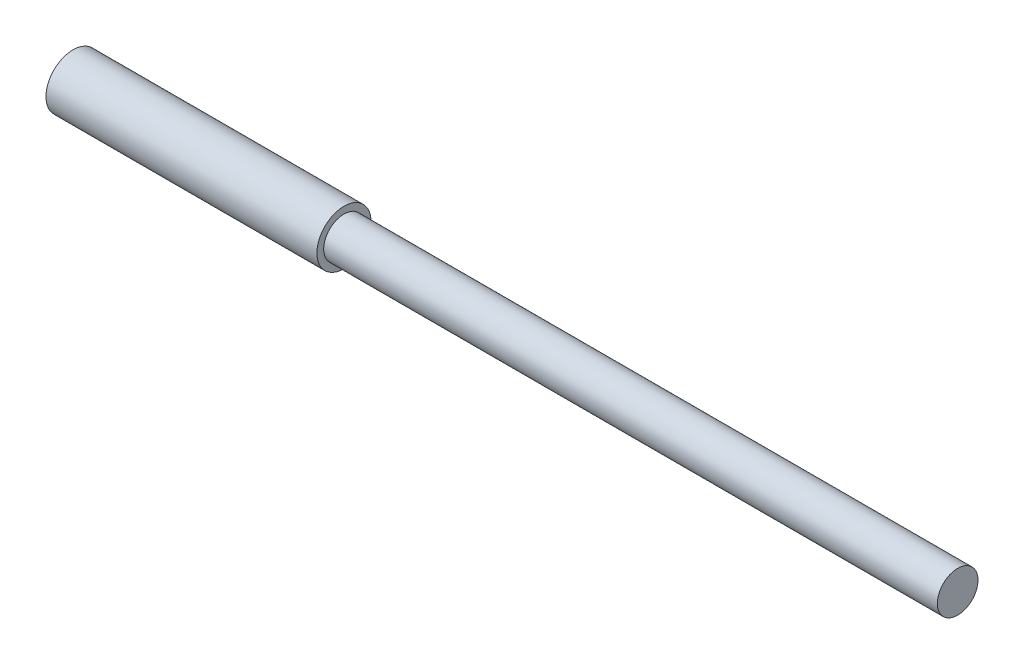
ISO-10303-21;
HEADER;
FILE_DESCRIPTION(('STEP AP214'),'2;1');
FILE_NAME('part.step','',(''),(''),'','','');
FILE_SCHEMA(('AUTOMOTIVE_DESIGN { 1 0 10303 214 1 1 1 1 }'));
ENDSEC;
DATA;
#1=APPLICATION_CONTEXT('core data for automotive mechanical design processes');
#2=APPLICATION_PROTOCOL_DEFINITION('international standard','automotive_design',2000,#1);
#3=PRODUCT_CONTEXT('',#1,'mechanical');
#4=PRODUCT('Part','Part','',(#3));
#5=PRODUCT_RELATED_PRODUCT_CATEGORY('part','',(#4));
#6=PRODUCT_DEFINITION_FORMATION('','',#4);
#7=PRODUCT_DEFINITION_CONTEXT('part definition',#1,'design');
#8=PRODUCT_DEFINITION('design','',#6,#7);
#9=PRODUCT_DEFINITION_SHAPE('','',#8);
#10=(LENGTH_UNIT() NAMED_UNIT(*) SI_UNIT(.MILLI.,.METRE.));
#11=(NAMED_UNIT(*) PLANE_ANGLE_UNIT() SI_UNIT($,.RADIAN.));
#12=(NAMED_UNIT(*) SI_UNIT($,.STERADIAN.) SOLID_ANGLE_UNIT());
#13=UNCERTAINTY_MEASURE_WITH_UNIT(LENGTH_MEASURE(1.E-05),#10,'distance_accuracy_value','');
#14=(GEOMETRIC_REPRESENTATION_CONTEXT(3) GLOBAL_UNCERTAINTY_ASSIGNED_CONTEXT((#13)) GLOBAL_UNIT_ASSIGNED_CONTEXT((#10,
#11,#12)) REPRESENTATION_CONTEXT('',''));
#15=CARTESIAN_POINT('',(0.,0.,0.));
#16=DIRECTION('',(0.,0.,1.));
#17=DIRECTION('',(1.,0.,0.));
#18=AXIS2_PLACEMENT_3D('',#15,#16,#17);
#19=CARTESIAN_POINT('',(20.,0.,0.));
#20=DIRECTION('',(1.,0.,0.));
#21=DIRECTION('',(0.,0.,-1.));
#22=AXIS2_PLACEMENT_3D('',#19,#20,#21);
#23=PLANE('',#22);
#24=CARTESIAN_POINT('',(20.,0.,0.));
#25=DIRECTION('',(1.,0.,0.));
#26=DIRECTION('',(0.,0.,-1.));
#27=AXIS2_PLACEMENT_3D('',#24,#25,#26);
#28=CIRCLE('',#27,2.);
#29=CARTESIAN_POINT('',(20.,0.,-2.));
#30=VERTEX_POINT('',#29);
#31=EDGE_CURVE('E10',#30,#30,#28,.T.);
#32=ORIENTED_EDGE('',*,*,#31,.T.);
#33=EDGE_LOOP('',(#32));
#34=FACE_BOUND('',#33,.T.);
#35=CARTESIAN_POINT('',(20.,0.,0.));
#36=DIRECTION('',(1.,0.,0.));
#37=DIRECTION('',(0.,0.,-1.));
#38=AXIS2_PLACEMENT_3D('',#35,#36,#37);
#39=CIRCLE('',#38,1.5);
#40=CARTESIAN_POINT('',(20.,0.,-1.5));
#41=VERTEX_POINT('',#40);
#42=EDGE_CURVE('E44',#41,#41,#39,.T.);
#43=ORIENTED_EDGE('',*,*,#42,.F.);
#44=EDGE_LOOP('',(#43));
#45=FACE_BOUND('',#44,.T.);
#46=ADVANCED_FACE('F31',(#34,#45),#23,.T.);
#47=CARTESIAN_POINT('',(20.,0.,0.));
#48=DIRECTION('',(-1.,0.,0.));
#49=DIRECTION('',(0.,0.,1.));
#50=AXIS2_PLACEMENT_3D('',#47,#48,#49);
#51=CYLINDRICAL_SURFACE('',#50,2.);
#52=ORIENTED_EDGE('',*,*,#31,.F.);
#53=EDGE_LOOP('',(#52));
#54=FACE_BOUND('',#53,.T.);
#55=CARTESIAN_POINT('',(0.,0.,0.));
#56=DIRECTION('',(1.,0.,0.));
#57=DIRECTION('',(0.,0.,-1.));
#58=AXIS2_PLACEMENT_3D('',#55,#56,#57);
#59=CIRCLE('',#58,2.);
#60=CARTESIAN_POINT('',(0.,0.,-2.));
#61=VERTEX_POINT('',#60);
#62=EDGE_CURVE('E35',#61,#61,#59,.T.);
#63=ORIENTED_EDGE('',*,*,#62,.T.);
#64=EDGE_LOOP('',(#63));
#65=FACE_BOUND('',#64,.T.);
#66=ADVANCED_FACE('F33',(#54,#65),#51,.T.);
#67=CARTESIAN_POINT('',(0.,0.,0.));
#68=DIRECTION('',(1.,0.,0.));
#69=DIRECTION('',(0.,0.,-1.));
#70=AXIS2_PLACEMENT_3D('',#67,#68,#69);
#71=PLANE('',#70);
#72=ORIENTED_EDGE('',*,*,#62,.F.);
#73=EDGE_LOOP('',(#72));
#74=FACE_BOUND('',#73,.T.);
#75=ADVANCED_FACE('F55',(#74),#71,.F.);
#76=CARTESIAN_POINT('',(65.3,0.,0.));
#77=DIRECTION('',(-1.,0.,0.));
#78=DIRECTION('',(0.,0.,1.));
#79=AXIS2_PLACEMENT_3D('',#76,#77,#78);
#80=CYLINDRICAL_SURFACE('',#79,1.5);
#81=CARTESIAN_POINT('',(65.3,0.,0.));
#82=DIRECTION('',(1.,0.,0.));
#83=DIRECTION('',(0.,0.,-1.));
#84=AXIS2_PLACEMENT_3D('',#81,#82,#83);
#85=CIRCLE('',#84,1.5);
#86=CARTESIAN_POINT('',(65.3,0.,-1.5));
#87=VERTEX_POINT('',#86);
#88=EDGE_CURVE('E42',#87,#87,#85,.T.);
#89=ORIENTED_EDGE('',*,*,#88,.F.);
#90=EDGE_LOOP('',(#89));
#91=FACE_BOUND('',#90,.T.);
#92=ORIENTED_EDGE('',*,*,#42,.T.);
#93=EDGE_LOOP('',(#92));
#94=FACE_BOUND('',#93,.T.);
#95=ADVANCED_FACE('F52',(#91,#94),#80,.T.);
#96=CARTESIAN_POINT('',(65.3,0.,0.));
#97=DIRECTION('',(1.,0.,0.));
#98=DIRECTION('',(0.,0.,-1.));
#99=AXIS2_PLACEMENT_3D('',#96,#97,#98);
#100=PLANE('',#99);
#101=ORIENTED_EDGE('',*,*,#88,.T.);
#102=EDGE_LOOP('',(#101));
#103=FACE_BOUND('',#102,.T.);
#104=ADVANCED_FACE('F50',(#103),#100,.T.);
#105=CLOSED_SHELL('',(#46,#66,#75,#95,#104));
#106=MANIFOLD_SOLID_BREP('B2',#105);
#107=ADVANCED_BREP_SHAPE_REPRESENTATION('',(#18,#106),#14);
#108=SHAPE_DEFINITION_REPRESENTATION(#9,#107);
ENDSEC;
END-ISO-10303-21;
